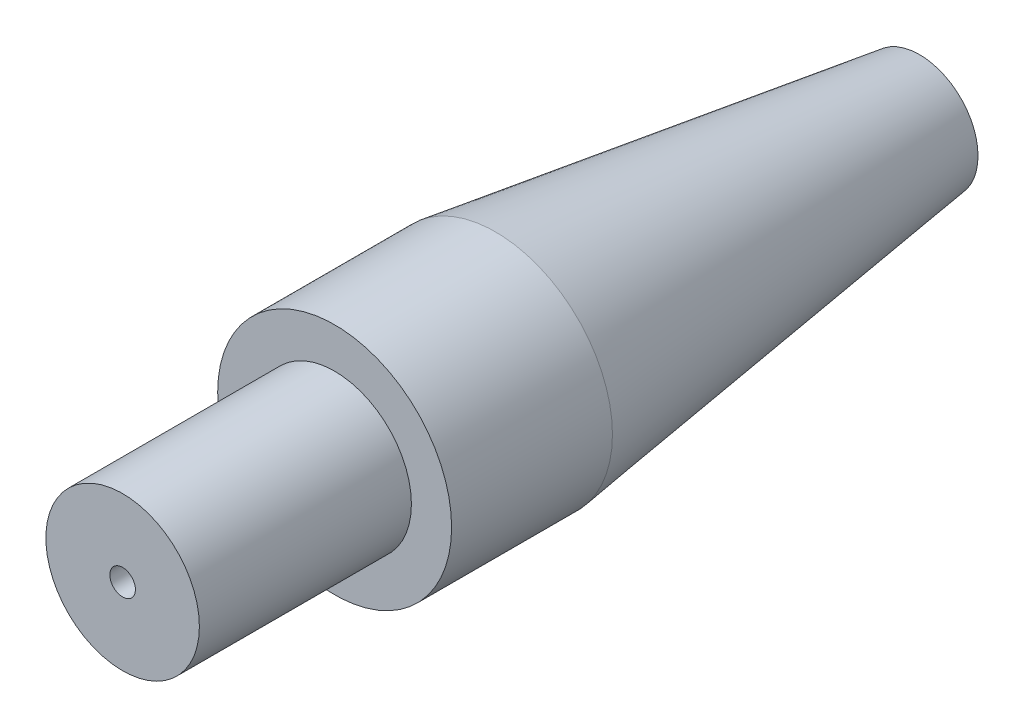
ISO-10303-21;
HEADER;
FILE_DESCRIPTION(('STEP AP214'),'2;1');
FILE_NAME('part.step','',(''),(''),'','','');
FILE_SCHEMA(('AUTOMOTIVE_DESIGN { 1 0 10303 214 1 1 1 1 }'));
ENDSEC;
DATA;
#1=APPLICATION_CONTEXT('core data for automotive mechanical design processes');
#2=APPLICATION_PROTOCOL_DEFINITION('international standard','automotive_design',2000,#1);
#3=PRODUCT_CONTEXT('',#1,'mechanical');
#4=PRODUCT('Part','Part','',(#3));
#5=PRODUCT_RELATED_PRODUCT_CATEGORY('part','',(#4));
#6=PRODUCT_DEFINITION_FORMATION('','',#4);
#7=PRODUCT_DEFINITION_CONTEXT('part definition',#1,'design');
#8=PRODUCT_DEFINITION('design','',#6,#7);
#9=PRODUCT_DEFINITION_SHAPE('','',#8);
#10=(LENGTH_UNIT() NAMED_UNIT(*) SI_UNIT(.MILLI.,.METRE.));
#11=(NAMED_UNIT(*) PLANE_ANGLE_UNIT() SI_UNIT($,.RADIAN.));
#12=(NAMED_UNIT(*) SI_UNIT($,.STERADIAN.) SOLID_ANGLE_UNIT());
#13=UNCERTAINTY_MEASURE_WITH_UNIT(LENGTH_MEASURE(1.E-05),#10,'distance_accuracy_value','');
#14=(GEOMETRIC_REPRESENTATION_CONTEXT(3) GLOBAL_UNCERTAINTY_ASSIGNED_CONTEXT((#13)) GLOBAL_UNIT_ASSIGNED_CONTEXT((#10,
#11,#12)) REPRESENTATION_CONTEXT('',''));
#15=CARTESIAN_POINT('',(0.,0.,0.));
#16=DIRECTION('',(0.,0.,1.));
#17=DIRECTION('',(1.,0.,0.));
#18=AXIS2_PLACEMENT_3D('',#15,#16,#17);
#19=CARTESIAN_POINT('',(0.4445,0.,-20.32));
#20=DIRECTION('',(0.,0.,-1.));
#21=DIRECTION('',(-1.,0.,0.));
#22=AXIS2_PLACEMENT_3D('',#19,#20,#21);
#23=PLANE('',#22);
#24=CARTESIAN_POINT('',(0.,0.,-20.32));
#25=DIRECTION('',(0.,0.,1.));
#26=DIRECTION('',(1.,0.,0.));
#27=AXIS2_PLACEMENT_3D('',#24,#25,#26);
#28=CIRCLE('',#27,0.4445);
#29=CARTESIAN_POINT('',(0.4445,0.,-20.32));
#30=VERTEX_POINT('',#29);
#31=EDGE_CURVE('E10',#30,#30,#28,.T.);
#32=ORIENTED_EDGE('',*,*,#31,.T.);
#33=EDGE_LOOP('',(#32));
#34=FACE_BOUND('',#33,.T.);
#35=CARTESIAN_POINT('',(0.,0.,-20.32));
#36=DIRECTION('',(0.,0.,1.));
#37=DIRECTION('',(1.,0.,0.));
#38=AXIS2_PLACEMENT_3D('',#35,#36,#37);
#39=CIRCLE('',#38,2.032);
#40=CARTESIAN_POINT('',(2.032,0.,-20.32));
#41=VERTEX_POINT('',#40);
#42=EDGE_CURVE('E56',#41,#41,#39,.T.);
#43=ORIENTED_EDGE('',*,*,#42,.F.);
#44=EDGE_LOOP('',(#43));
#45=FACE_BOUND('',#44,.T.);
#46=ADVANCED_FACE('F31',(#34,#45),#23,.T.);
#47=CARTESIAN_POINT('',(0.,0.,0.));
#48=DIRECTION('',(0.,0.,1.));
#49=DIRECTION('',(1.,0.,0.));
#50=AXIS2_PLACEMENT_3D('',#47,#48,#49);
#51=CYLINDRICAL_SURFACE('',#50,0.444500000000002);
#52=CARTESIAN_POINT('',(0.,0.,7.366));
#53=DIRECTION('',(0.,0.,1.));
#54=DIRECTION('',(1.,0.,0.));
#55=AXIS2_PLACEMENT_3D('',#52,#53,#54);
#56=CIRCLE('',#55,0.444500000000003);
#57=CARTESIAN_POINT('',(0.444500000000003,0.,7.366));
#58=VERTEX_POINT('',#57);
#59=EDGE_CURVE('E37',#58,#58,#56,.T.);
#60=ORIENTED_EDGE('',*,*,#59,.T.);
#61=EDGE_LOOP('',(#60));
#62=FACE_BOUND('',#61,.T.);
#63=ORIENTED_EDGE('',*,*,#31,.F.);
#64=EDGE_LOOP('',(#63));
#65=FACE_BOUND('',#64,.T.);
#66=ADVANCED_FACE('F64',(#62,#65),#51,.F.);
#67=CARTESIAN_POINT('',(2.667,0.,7.366));
#68=DIRECTION('',(0.,0.,1.));
#69=DIRECTION('',(1.,0.,0.));
#70=AXIS2_PLACEMENT_3D('',#67,#68,#69);
#71=PLANE('',#70);
#72=CARTESIAN_POINT('',(0.,0.,7.366));
#73=DIRECTION('',(0.,0.,1.));
#74=DIRECTION('',(1.,0.,0.));
#75=AXIS2_PLACEMENT_3D('',#72,#73,#74);
#76=CIRCLE('',#75,2.667);
#77=CARTESIAN_POINT('',(2.667,0.,7.366));
#78=VERTEX_POINT('',#77);
#79=EDGE_CURVE('E41',#78,#78,#76,.T.);
#80=ORIENTED_EDGE('',*,*,#79,.T.);
#81=EDGE_LOOP('',(#80));
#82=FACE_BOUND('',#81,.T.);
#83=ORIENTED_EDGE('',*,*,#59,.F.);
#84=EDGE_LOOP('',(#83));
#85=FACE_BOUND('',#84,.T.);
#86=ADVANCED_FACE('F68',(#82,#85),#71,.T.);
#87=CARTESIAN_POINT('',(0.,0.,0.));
#88=DIRECTION('',(0.,0.,1.));
#89=DIRECTION('',(1.,0.,0.));
#90=AXIS2_PLACEMENT_3D('',#87,#88,#89);
#91=CYLINDRICAL_SURFACE('',#90,2.667);
#92=CARTESIAN_POINT('',(0.,0.,0.));
#93=DIRECTION('',(0.,0.,1.));
#94=DIRECTION('',(1.,0.,0.));
#95=AXIS2_PLACEMENT_3D('',#92,#93,#94);
#96=CIRCLE('',#95,2.667);
#97=CARTESIAN_POINT('',(2.667,0.,0.));
#98=VERTEX_POINT('',#97);
#99=EDGE_CURVE('E45',#98,#98,#96,.T.);
#100=ORIENTED_EDGE('',*,*,#99,.T.);
#101=EDGE_LOOP('',(#100));
#102=FACE_BOUND('',#101,.T.);
#103=ORIENTED_EDGE('',*,*,#79,.F.);
#104=EDGE_LOOP('',(#103));
#105=FACE_BOUND('',#104,.T.);
#106=ADVANCED_FACE('F72',(#102,#105),#91,.T.);
#107=CARTESIAN_POINT('',(4.064,0.,0.));
#108=DIRECTION('',(0.,0.,1.));
#109=DIRECTION('',(1.,0.,0.));
#110=AXIS2_PLACEMENT_3D('',#107,#108,#109);
#111=PLANE('',#110);
#112=CARTESIAN_POINT('',(0.,0.,0.));
#113=DIRECTION('',(0.,0.,1.));
#114=DIRECTION('',(1.,0.,0.));
#115=AXIS2_PLACEMENT_3D('',#112,#113,#114);
#116=CIRCLE('',#115,4.064);
#117=CARTESIAN_POINT('',(4.064,0.,0.));
#118=VERTEX_POINT('',#117);
#119=EDGE_CURVE('E50',#118,#118,#116,.T.);
#120=ORIENTED_EDGE('',*,*,#119,.T.);
#121=EDGE_LOOP('',(#120));
#122=FACE_BOUND('',#121,.T.);
#123=ORIENTED_EDGE('',*,*,#99,.F.);
#124=EDGE_LOOP('',(#123));
#125=FACE_BOUND('',#124,.T.);
#126=ADVANCED_FACE('F79',(#122,#125),#111,.T.);
#127=CARTESIAN_POINT('',(0.,0.,0.));
#128=DIRECTION('',(0.,0.,1.));
#129=DIRECTION('',(1.,0.,0.));
#130=AXIS2_PLACEMENT_3D('',#127,#128,#129);
#131=CYLINDRICAL_SURFACE('',#130,4.064);
#132=CARTESIAN_POINT('',(0.,0.,-5.588));
#133=DIRECTION('',(0.,0.,1.));
#134=DIRECTION('',(1.,0.,0.));
#135=AXIS2_PLACEMENT_3D('',#132,#133,#134);
#136=CIRCLE('',#135,4.064);
#137=CARTESIAN_POINT('',(4.064,0.,-5.588));
#138=VERTEX_POINT('',#137);
#139=EDGE_CURVE('E53',#138,#138,#136,.T.);
#140=ORIENTED_EDGE('',*,*,#139,.T.);
#141=EDGE_LOOP('',(#140));
#142=FACE_BOUND('',#141,.T.);
#143=ORIENTED_EDGE('',*,*,#119,.F.);
#144=EDGE_LOOP('',(#143));
#145=FACE_BOUND('',#144,.T.);
#146=ADVANCED_FACE('F83',(#142,#145),#131,.T.);
#147=CARTESIAN_POINT('',(0.,0.,-5.588));
#148=DIRECTION('',(0.,0.,1.));
#149=DIRECTION('',(1.,0.,0.));
#150=AXIS2_PLACEMENT_3D('',#147,#148,#149);
#151=CONICAL_SURFACE('',#150,4.064,0.137066174310188);
#152=ORIENTED_EDGE('',*,*,#42,.T.);
#153=EDGE_LOOP('',(#152));
#154=FACE_BOUND('',#153,.T.);
#155=ORIENTED_EDGE('',*,*,#139,.F.);
#156=EDGE_LOOP('',(#155));
#157=FACE_BOUND('',#156,.T.);
#158=ADVANCED_FACE('F60',(#154,#157),#151,.T.);
#159=CLOSED_SHELL('',(#46,#66,#86,#106,#126,#146,#158));
#160=MANIFOLD_SOLID_BREP('B2',#159);
#161=ADVANCED_BREP_SHAPE_REPRESENTATION('',(#18,#160),#14);
#162=SHAPE_DEFINITION_REPRESENTATION(#9,#161);
ENDSEC;
END-ISO-10303-21;
